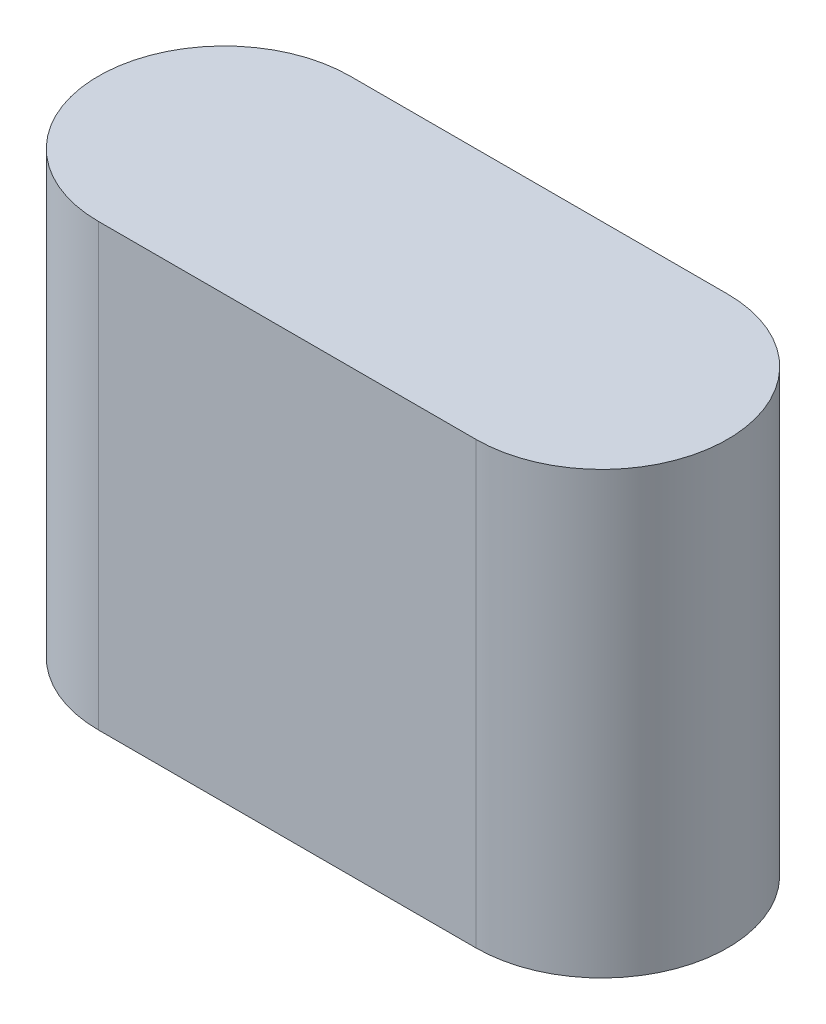
ISO-10303-21;
HEADER;
FILE_DESCRIPTION(('STEP AP214'),'2;1');
FILE_NAME('part.step','',(''),(''),'','','');
FILE_SCHEMA(('AUTOMOTIVE_DESIGN { 1 0 10303 214 1 1 1 1 }'));
ENDSEC;
DATA;
#1=APPLICATION_CONTEXT('core data for automotive mechanical design processes');
#2=APPLICATION_PROTOCOL_DEFINITION('international standard','automotive_design',2000,#1);
#3=PRODUCT_CONTEXT('',#1,'mechanical');
#4=PRODUCT('Part','Part','',(#3));
#5=PRODUCT_RELATED_PRODUCT_CATEGORY('part','',(#4));
#6=PRODUCT_DEFINITION_FORMATION('','',#4);
#7=PRODUCT_DEFINITION_CONTEXT('part definition',#1,'design');
#8=PRODUCT_DEFINITION('design','',#6,#7);
#9=PRODUCT_DEFINITION_SHAPE('','',#8);
#10=(LENGTH_UNIT() NAMED_UNIT(*) SI_UNIT(.MILLI.,.METRE.));
#11=(NAMED_UNIT(*) PLANE_ANGLE_UNIT() SI_UNIT($,.RADIAN.));
#12=(NAMED_UNIT(*) SI_UNIT($,.STERADIAN.) SOLID_ANGLE_UNIT());
#13=UNCERTAINTY_MEASURE_WITH_UNIT(LENGTH_MEASURE(1.E-05),#10,'distance_accuracy_value','');
#14=(GEOMETRIC_REPRESENTATION_CONTEXT(3) GLOBAL_UNCERTAINTY_ASSIGNED_CONTEXT((#13)) GLOBAL_UNIT_ASSIGNED_CONTEXT((#10,
#11,#12)) REPRESENTATION_CONTEXT('',''));
#15=CARTESIAN_POINT('',(0.,0.,0.));
#16=DIRECTION('',(0.,0.,1.));
#17=DIRECTION('',(1.,0.,0.));
#18=AXIS2_PLACEMENT_3D('',#15,#16,#17);
#19=CARTESIAN_POINT('',(-11.9246861924686,35.,0.));
#20=DIRECTION('',(0.,-1.,0.));
#21=DIRECTION('',(0.,0.,-1.));
#22=AXIS2_PLACEMENT_3D('',#19,#20,#21);
#23=CYLINDRICAL_SURFACE('',#22,10.);
#24=CARTESIAN_POINT('',(-11.9246861924686,0.,0.));
#25=DIRECTION('',(0.,1.,0.));
#26=DIRECTION('',(0.,0.,1.));
#27=AXIS2_PLACEMENT_3D('',#24,#25,#26);
#28=CIRCLE('',#27,10.);
#29=CARTESIAN_POINT('',(-11.9246861924686,0.,-10.));
#30=VERTEX_POINT('',#29);
#31=CARTESIAN_POINT('',(-11.9246861924686,0.,10.));
#32=VERTEX_POINT('',#31);
#33=EDGE_CURVE('E113',#30,#32,#28,.T.);
#34=ORIENTED_EDGE('',*,*,#33,.T.);
#35=DIRECTION('',(0.,-1.,0.));
#36=VECTOR('',#35,1.);
#37=CARTESIAN_POINT('',(-11.9246861924686,35.,10.));
#38=LINE('',#37,#36);
#39=CARTESIAN_POINT('',(-11.9246861924686,35.,10.));
#40=VERTEX_POINT('',#39);
#41=EDGE_CURVE('E11',#40,#32,#38,.T.);
#42=ORIENTED_EDGE('',*,*,#41,.F.);
#43=CARTESIAN_POINT('',(-11.9246861924686,35.,0.));
#44=DIRECTION('',(0.,1.,0.));
#45=DIRECTION('',(0.,0.,1.));
#46=AXIS2_PLACEMENT_3D('',#43,#44,#45);
#47=CIRCLE('',#46,10.);
#48=CARTESIAN_POINT('',(-11.9246861924686,35.,-10.));
#49=VERTEX_POINT('',#48);
#50=EDGE_CURVE('E97',#49,#40,#47,.T.);
#51=ORIENTED_EDGE('',*,*,#50,.F.);
#52=DIRECTION('',(0.,-1.,0.));
#53=VECTOR('',#52,1.);
#54=CARTESIAN_POINT('',(-11.9246861924686,35.,-10.));
#55=LINE('',#54,#53);
#56=EDGE_CURVE('E109',#49,#30,#55,.T.);
#57=ORIENTED_EDGE('',*,*,#56,.T.);
#58=EDGE_LOOP('',(#34,#42,#51,#57));
#59=FACE_BOUND('',#58,.T.);
#60=ADVANCED_FACE('F45',(#59),#23,.T.);
#61=CARTESIAN_POINT('',(-11.9246861924686,35.,10.));
#62=DIRECTION('',(0.,0.,-1.));
#63=DIRECTION('',(-1.,0.,0.));
#64=AXIS2_PLACEMENT_3D('',#61,#62,#63);
#65=PLANE('',#64);
#66=DIRECTION('',(1.,0.,0.));
#67=VECTOR('',#66,1.);
#68=CARTESIAN_POINT('',(-11.9246861924686,0.,10.));
#69=LINE('',#68,#67);
#70=CARTESIAN_POINT('',(18.0753138075314,0.,10.));
#71=VERTEX_POINT('',#70);
#72=EDGE_CURVE('E102',#32,#71,#69,.T.);
#73=ORIENTED_EDGE('',*,*,#72,.T.);
#74=DIRECTION('',(0.,-1.,0.));
#75=VECTOR('',#74,1.);
#76=CARTESIAN_POINT('',(18.0753138075314,35.,10.));
#77=LINE('',#76,#75);
#78=CARTESIAN_POINT('',(18.0753138075314,35.,10.));
#79=VERTEX_POINT('',#78);
#80=EDGE_CURVE('E54',#79,#71,#77,.T.);
#81=ORIENTED_EDGE('',*,*,#80,.F.);
#82=DIRECTION('',(1.,0.,0.));
#83=VECTOR('',#82,1.);
#84=CARTESIAN_POINT('',(-11.9246861924686,35.,10.));
#85=LINE('',#84,#83);
#86=EDGE_CURVE('E92',#40,#79,#85,.T.);
#87=ORIENTED_EDGE('',*,*,#86,.F.);
#88=ORIENTED_EDGE('',*,*,#41,.T.);
#89=EDGE_LOOP('',(#73,#81,#87,#88));
#90=FACE_BOUND('',#89,.T.);
#91=ADVANCED_FACE('F101',(#90),#65,.F.);
#92=CARTESIAN_POINT('',(18.0753138075314,35.,0.));
#93=DIRECTION('',(0.,-1.,0.));
#94=DIRECTION('',(0.,0.,-1.));
#95=AXIS2_PLACEMENT_3D('',#92,#93,#94);
#96=CYLINDRICAL_SURFACE('',#95,10.);
#97=CARTESIAN_POINT('',(18.0753138075314,0.,0.));
#98=DIRECTION('',(0.,1.,0.));
#99=DIRECTION('',(0.,0.,1.));
#100=AXIS2_PLACEMENT_3D('',#97,#98,#99);
#101=CIRCLE('',#100,10.);
#102=CARTESIAN_POINT('',(18.0753138075314,0.,-10.));
#103=VERTEX_POINT('',#102);
#104=EDGE_CURVE('E79',#71,#103,#101,.T.);
#105=ORIENTED_EDGE('',*,*,#104,.T.);
#106=DIRECTION('',(0.,-1.,0.));
#107=VECTOR('',#106,1.);
#108=CARTESIAN_POINT('',(18.0753138075314,35.,-10.));
#109=LINE('',#108,#107);
#110=CARTESIAN_POINT('',(18.0753138075314,35.,-10.));
#111=VERTEX_POINT('',#110);
#112=EDGE_CURVE('E104',#111,#103,#109,.T.);
#113=ORIENTED_EDGE('',*,*,#112,.F.);
#114=CARTESIAN_POINT('',(18.0753138075314,35.,0.));
#115=DIRECTION('',(0.,1.,0.));
#116=DIRECTION('',(0.,0.,1.));
#117=AXIS2_PLACEMENT_3D('',#114,#115,#116);
#118=CIRCLE('',#117,10.);
#119=EDGE_CURVE('E95',#79,#111,#118,.T.);
#120=ORIENTED_EDGE('',*,*,#119,.F.);
#121=ORIENTED_EDGE('',*,*,#80,.T.);
#122=EDGE_LOOP('',(#105,#113,#120,#121));
#123=FACE_BOUND('',#122,.T.);
#124=ADVANCED_FACE('F105',(#123),#96,.T.);
#125=CARTESIAN_POINT('',(-11.9246861924686,35.,-10.));
#126=DIRECTION('',(0.,0.,1.));
#127=DIRECTION('',(1.,0.,0.));
#128=AXIS2_PLACEMENT_3D('',#125,#126,#127);
#129=PLANE('',#128);
#130=DIRECTION('',(-1.,0.,0.));
#131=VECTOR('',#130,1.);
#132=CARTESIAN_POINT('',(-11.9246861924686,0.,-10.));
#133=LINE('',#132,#131);
#134=EDGE_CURVE('E85',#103,#30,#133,.T.);
#135=ORIENTED_EDGE('',*,*,#134,.T.);
#136=ORIENTED_EDGE('',*,*,#56,.F.);
#137=DIRECTION('',(-1.,0.,0.));
#138=VECTOR('',#137,1.);
#139=CARTESIAN_POINT('',(-11.9246861924686,35.,-10.));
#140=LINE('',#139,#138);
#141=EDGE_CURVE('E62',#111,#49,#140,.T.);
#142=ORIENTED_EDGE('',*,*,#141,.F.);
#143=ORIENTED_EDGE('',*,*,#112,.T.);
#144=EDGE_LOOP('',(#135,#136,#142,#143));
#145=FACE_BOUND('',#144,.T.);
#146=ADVANCED_FACE('F126',(#145),#129,.F.);
#147=CARTESIAN_POINT('',(-11.9246861924686,35.,0.));
#148=DIRECTION('',(0.,1.,0.));
#149=DIRECTION('',(0.,0.,1.));
#150=AXIS2_PLACEMENT_3D('',#147,#148,#149);
#151=PLANE('',#150);
#152=ORIENTED_EDGE('',*,*,#50,.T.);
#153=ORIENTED_EDGE('',*,*,#86,.T.);
#154=ORIENTED_EDGE('',*,*,#119,.T.);
#155=ORIENTED_EDGE('',*,*,#141,.T.);
#156=EDGE_LOOP('',(#152,#153,#154,#155));
#157=FACE_BOUND('',#156,.T.);
#158=ADVANCED_FACE('F93',(#157),#151,.T.);
#159=CARTESIAN_POINT('',(-11.9246861924686,0.,0.));
#160=DIRECTION('',(0.,1.,0.));
#161=DIRECTION('',(0.,0.,1.));
#162=AXIS2_PLACEMENT_3D('',#159,#160,#161);
#163=PLANE('',#162);
#164=ORIENTED_EDGE('',*,*,#33,.F.);
#165=ORIENTED_EDGE('',*,*,#134,.F.);
#166=ORIENTED_EDGE('',*,*,#104,.F.);
#167=ORIENTED_EDGE('',*,*,#72,.F.);
#168=EDGE_LOOP('',(#164,#165,#166,#167));
#169=FACE_BOUND('',#168,.T.);
#170=ADVANCED_FACE('F129',(#169),#163,.F.);
#171=CLOSED_SHELL('',(#60,#91,#124,#146,#158,#170));
#172=MANIFOLD_SOLID_BREP('B2',#171);
#173=ADVANCED_BREP_SHAPE_REPRESENTATION('',(#18,#172),#14);
#174=SHAPE_DEFINITION_REPRESENTATION(#9,#173);
ENDSEC;
END-ISO-10303-21;
